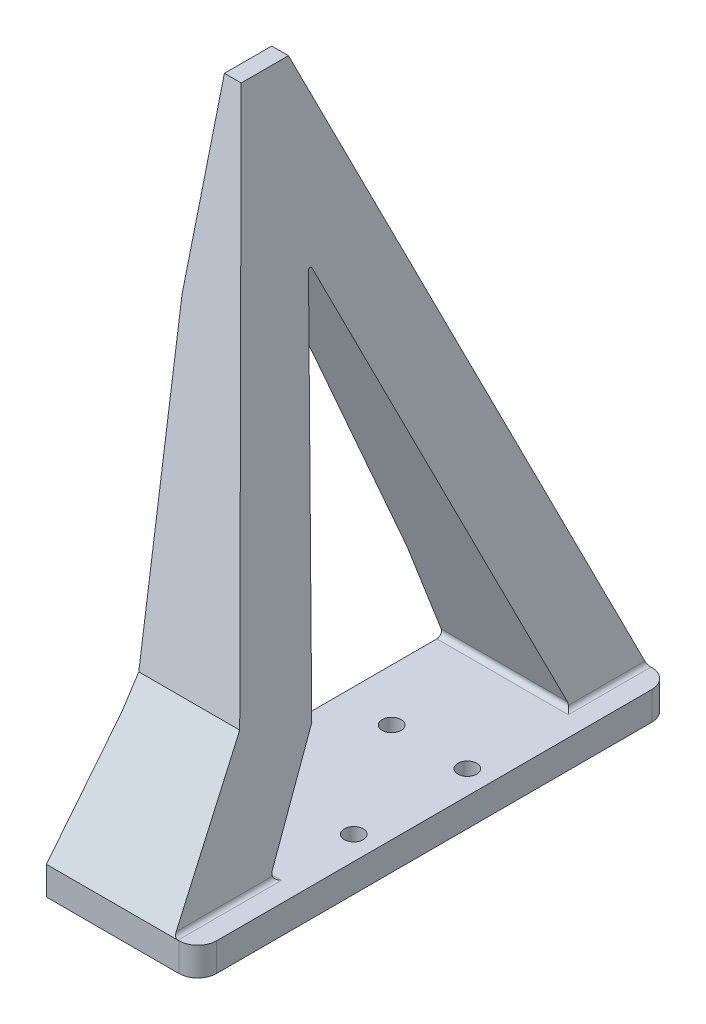
ISO-10303-21;
HEADER;
FILE_DESCRIPTION(('STEP AP214'),'2;1');
FILE_NAME('part.step','',(''),(''),'','','');
FILE_SCHEMA(('AUTOMOTIVE_DESIGN { 1 0 10303 214 1 1 1 1 }'));
ENDSEC;
DATA;
#1=APPLICATION_CONTEXT('core data for automotive mechanical design processes');
#2=APPLICATION_PROTOCOL_DEFINITION('international standard','automotive_design',2000,#1);
#3=PRODUCT_CONTEXT('',#1,'mechanical');
#4=PRODUCT('Part','Part','',(#3));
#5=PRODUCT_RELATED_PRODUCT_CATEGORY('part','',(#4));
#6=PRODUCT_DEFINITION_FORMATION('','',#4);
#7=PRODUCT_DEFINITION_CONTEXT('part definition',#1,'design');
#8=PRODUCT_DEFINITION('design','',#6,#7);
#9=PRODUCT_DEFINITION_SHAPE('','',#8);
#10=(LENGTH_UNIT() NAMED_UNIT(*) SI_UNIT(.MILLI.,.METRE.));
#11=(NAMED_UNIT(*) PLANE_ANGLE_UNIT() SI_UNIT($,.RADIAN.));
#12=(NAMED_UNIT(*) SI_UNIT($,.STERADIAN.) SOLID_ANGLE_UNIT());
#13=UNCERTAINTY_MEASURE_WITH_UNIT(LENGTH_MEASURE(1.E-05),#10,'distance_accuracy_value','');
#14=(GEOMETRIC_REPRESENTATION_CONTEXT(3) GLOBAL_UNCERTAINTY_ASSIGNED_CONTEXT((#13)) GLOBAL_UNIT_ASSIGNED_CONTEXT((#10,
#11,#12)) REPRESENTATION_CONTEXT('',''));
#15=CARTESIAN_POINT('',(0.,0.,0.));
#16=DIRECTION('',(0.,0.,1.));
#17=DIRECTION('',(1.,0.,0.));
#18=AXIS2_PLACEMENT_3D('',#15,#16,#17);
#19=CARTESIAN_POINT('',(7.25,3.,23.));
#20=DIRECTION('',(0.,1.,0.));
#21=DIRECTION('',(0.,0.,1.));
#22=AXIS2_PLACEMENT_3D('',#19,#20,#21);
#23=PLANE('',#22);
#24=DIRECTION('',(-1.,0.,0.));
#25=VECTOR('',#24,1.);
#26=CARTESIAN_POINT('',(-9.25000000000001,3.,-25.));
#27=LINE('',#26,#25);
#28=CARTESIAN_POINT('',(7.25,3.,-25.));
#29=VERTEX_POINT('',#28);
#30=CARTESIAN_POINT('',(7.14980374572616,3.,-25.));
#31=VERTEX_POINT('',#30);
#32=EDGE_CURVE('E222',#29,#31,#27,.T.);
#33=ORIENTED_EDGE('',*,*,#32,.T.);
#34=DIRECTION('',(0.,0.,-1.));
#35=VECTOR('',#34,1.);
#36=CARTESIAN_POINT('',(7.14980374572616,3.,23.));
#37=LINE('',#36,#35);
#38=CARTESIAN_POINT('',(7.14980374572616,3.,-16.2707965265877));
#39=VERTEX_POINT('',#38);
#40=EDGE_CURVE('E264',#31,#39,#37,.F.);
#41=ORIENTED_EDGE('',*,*,#40,.T.);
#42=DIRECTION('',(1.,0.,0.));
#43=VECTOR('',#42,1.);
#44=CARTESIAN_POINT('',(7.25,3.,-16.2707965265877));
#45=LINE('',#44,#43);
#46=CARTESIAN_POINT('',(-6.75,3.,-16.2707965265877));
#47=VERTEX_POINT('',#46);
#48=EDGE_CURVE('E262',#39,#47,#45,.F.);
#49=ORIENTED_EDGE('',*,*,#48,.T.);
#50=DIRECTION('',(0.,0.,-1.));
#51=VECTOR('',#50,1.);
#52=CARTESIAN_POINT('',(-6.75,3.,23.));
#53=LINE('',#52,#51);
#54=CARTESIAN_POINT('',(-6.75,3.,14.0396722192133));
#55=VERTEX_POINT('',#54);
#56=EDGE_CURVE('E387',#55,#47,#53,.T.);
#57=ORIENTED_EDGE('',*,*,#56,.F.);
#58=DIRECTION('',(1.,0.,0.));
#59=VECTOR('',#58,1.);
#60=CARTESIAN_POINT('',(7.25,3.,14.0396722192133));
#61=LINE('',#60,#59);
#62=CARTESIAN_POINT('',(7.14980374572616,3.,14.0396722192133));
#63=VERTEX_POINT('',#62);
#64=EDGE_CURVE('E257',#55,#63,#61,.T.);
#65=ORIENTED_EDGE('',*,*,#64,.T.);
#66=DIRECTION('',(0.,0.,-1.));
#67=VECTOR('',#66,1.);
#68=CARTESIAN_POINT('',(7.14980374572616,3.,23.));
#69=LINE('',#68,#67);
#70=CARTESIAN_POINT('',(7.14980374572616,3.,25.));
#71=VERTEX_POINT('',#70);
#72=EDGE_CURVE('E259',#63,#71,#69,.F.);
#73=ORIENTED_EDGE('',*,*,#72,.T.);
#74=DIRECTION('',(1.,0.,0.));
#75=VECTOR('',#74,1.);
#76=CARTESIAN_POINT('',(-9.25,3.,25.));
#77=LINE('',#76,#75);
#78=CARTESIAN_POINT('',(7.25,3.,25.));
#79=VERTEX_POINT('',#78);
#80=EDGE_CURVE('E230',#71,#79,#77,.T.);
#81=ORIENTED_EDGE('',*,*,#80,.T.);
#82=CARTESIAN_POINT('',(7.25,3.,23.));
#83=DIRECTION('',(0.,1.,0.));
#84=DIRECTION('',(0.,0.,1.));
#85=AXIS2_PLACEMENT_3D('',#82,#83,#84);
#86=CIRCLE('',#85,2.);
#87=CARTESIAN_POINT('',(9.25,3.,23.));
#88=VERTEX_POINT('',#87);
#89=EDGE_CURVE('E360',#79,#88,#86,.T.);
#90=ORIENTED_EDGE('',*,*,#89,.T.);
#91=DIRECTION('',(0.,0.,-1.));
#92=VECTOR('',#91,1.);
#93=CARTESIAN_POINT('',(9.24999999999999,3.,-23.));
#94=LINE('',#93,#92);
#95=CARTESIAN_POINT('',(9.24999999999999,3.,-23.));
#96=VERTEX_POINT('',#95);
#97=EDGE_CURVE('E362',#88,#96,#94,.T.);
#98=ORIENTED_EDGE('',*,*,#97,.T.);
#99=CARTESIAN_POINT('',(7.25,3.,-23.));
#100=DIRECTION('',(0.,1.,0.));
#101=DIRECTION('',(0.,0.,-1.));
#102=AXIS2_PLACEMENT_3D('',#99,#100,#101);
#103=CIRCLE('',#102,2.);
#104=EDGE_CURVE('E363',#96,#29,#103,.T.);
#105=ORIENTED_EDGE('',*,*,#104,.T.);
#106=EDGE_LOOP('',(#33,#41,#49,#57,#65,#73,#81,#90,#98,#105));
#107=FACE_BOUND('',#106,.T.);
#108=CARTESIAN_POINT('',(6.75,3.,6.));
#109=DIRECTION('',(0.,1.,0.));
#110=DIRECTION('',(0.,0.,1.));
#111=AXIS2_PLACEMENT_3D('',#108,#109,#110);
#112=CIRCLE('',#111,1.);
#113=CARTESIAN_POINT('',(6.75,3.,7.));
#114=VERTEX_POINT('',#113);
#115=EDGE_CURVE('E348',#114,#114,#112,.T.);
#116=ORIENTED_EDGE('',*,*,#115,.F.);
#117=EDGE_LOOP('',(#116));
#118=FACE_BOUND('',#117,.T.);
#119=CARTESIAN_POINT('',(6.75,3.,-6.));
#120=DIRECTION('',(0.,1.,0.));
#121=DIRECTION('',(0.,0.,1.));
#122=AXIS2_PLACEMENT_3D('',#119,#120,#121);
#123=CIRCLE('',#122,1.);
#124=CARTESIAN_POINT('',(6.75,3.,-5.));
#125=VERTEX_POINT('',#124);
#126=EDGE_CURVE('E340',#125,#125,#123,.T.);
#127=ORIENTED_EDGE('',*,*,#126,.F.);
#128=EDGE_LOOP('',(#127));
#129=FACE_BOUND('',#128,.T.);
#130=CARTESIAN_POINT('',(-1.25,3.,6.));
#131=DIRECTION('',(0.,1.,0.));
#132=DIRECTION('',(0.,0.,1.));
#133=AXIS2_PLACEMENT_3D('',#130,#131,#132);
#134=CIRCLE('',#133,1.);
#135=CARTESIAN_POINT('',(-1.25,3.,7.));
#136=VERTEX_POINT('',#135);
#137=EDGE_CURVE('E331',#136,#136,#134,.T.);
#138=ORIENTED_EDGE('',*,*,#137,.F.);
#139=EDGE_LOOP('',(#138));
#140=FACE_BOUND('',#139,.T.);
#141=CARTESIAN_POINT('',(-1.25,3.,-6.));
#142=DIRECTION('',(0.,1.,0.));
#143=DIRECTION('',(0.,0.,1.));
#144=AXIS2_PLACEMENT_3D('',#141,#142,#143);
#145=CIRCLE('',#144,1.);
#146=CARTESIAN_POINT('',(-1.25,3.,-5.));
#147=VERTEX_POINT('',#146);
#148=EDGE_CURVE('E347',#147,#147,#145,.T.);
#149=ORIENTED_EDGE('',*,*,#148,.F.);
#150=EDGE_LOOP('',(#149));
#151=FACE_BOUND('',#150,.T.);
#152=ADVANCED_FACE('F34',(#107,#118,#129,#140,#151),#23,.T.);
#153=CARTESIAN_POINT('',(7.25,0.,23.));
#154=DIRECTION('',(0.,1.,0.));
#155=DIRECTION('',(0.,0.,1.));
#156=AXIS2_PLACEMENT_3D('',#153,#154,#155);
#157=PLANE('',#156);
#158=DIRECTION('',(1.,0.,0.));
#159=VECTOR('',#158,1.);
#160=CARTESIAN_POINT('',(-9.25,0.,25.));
#161=LINE('',#160,#159);
#162=CARTESIAN_POINT('',(-6.75,0.,25.));
#163=VERTEX_POINT('',#162);
#164=CARTESIAN_POINT('',(7.25,0.,25.));
#165=VERTEX_POINT('',#164);
#166=EDGE_CURVE('E203',#163,#165,#161,.T.);
#167=ORIENTED_EDGE('',*,*,#166,.F.);
#168=DIRECTION('',(0.,0.,-1.));
#169=VECTOR('',#168,1.);
#170=CARTESIAN_POINT('',(-6.75,0.,25.));
#171=LINE('',#170,#169);
#172=CARTESIAN_POINT('',(-6.75000000000001,0.,-25.));
#173=VERTEX_POINT('',#172);
#174=EDGE_CURVE('E184',#163,#173,#171,.T.);
#175=ORIENTED_EDGE('',*,*,#174,.T.);
#176=DIRECTION('',(-1.,0.,0.));
#177=VECTOR('',#176,1.);
#178=CARTESIAN_POINT('',(-9.25000000000001,0.,-25.));
#179=LINE('',#178,#177);
#180=CARTESIAN_POINT('',(7.25,0.,-25.));
#181=VERTEX_POINT('',#180);
#182=EDGE_CURVE('E228',#181,#173,#179,.T.);
#183=ORIENTED_EDGE('',*,*,#182,.F.);
#184=CARTESIAN_POINT('',(7.25,0.,-23.));
#185=DIRECTION('',(0.,1.,0.));
#186=DIRECTION('',(0.,0.,-1.));
#187=AXIS2_PLACEMENT_3D('',#184,#185,#186);
#188=CIRCLE('',#187,2.);
#189=CARTESIAN_POINT('',(9.24999999999999,0.,-23.));
#190=VERTEX_POINT('',#189);
#191=EDGE_CURVE('E226',#190,#181,#188,.T.);
#192=ORIENTED_EDGE('',*,*,#191,.F.);
#193=DIRECTION('',(0.,0.,-1.));
#194=VECTOR('',#193,1.);
#195=CARTESIAN_POINT('',(9.24999999999999,0.,-23.));
#196=LINE('',#195,#194);
#197=CARTESIAN_POINT('',(9.25,0.,23.));
#198=VERTEX_POINT('',#197);
#199=EDGE_CURVE('E216',#198,#190,#196,.T.);
#200=ORIENTED_EDGE('',*,*,#199,.F.);
#201=CARTESIAN_POINT('',(7.25,0.,23.));
#202=DIRECTION('',(0.,1.,0.));
#203=DIRECTION('',(0.,0.,1.));
#204=AXIS2_PLACEMENT_3D('',#201,#202,#203);
#205=CIRCLE('',#204,2.);
#206=EDGE_CURVE('E212',#165,#198,#205,.T.);
#207=ORIENTED_EDGE('',*,*,#206,.F.);
#208=EDGE_LOOP('',(#167,#175,#183,#192,#200,#207));
#209=FACE_BOUND('',#208,.T.);
#210=CARTESIAN_POINT('',(-1.25,0.,6.));
#211=DIRECTION('',(0.,1.,0.));
#212=DIRECTION('',(0.,0.,1.));
#213=AXIS2_PLACEMENT_3D('',#210,#211,#212);
#214=CIRCLE('',#213,1.);
#215=CARTESIAN_POINT('',(-1.25,0.,7.));
#216=VERTEX_POINT('',#215);
#217=EDGE_CURVE('E214',#216,#216,#214,.T.);
#218=ORIENTED_EDGE('',*,*,#217,.T.);
#219=EDGE_LOOP('',(#218));
#220=FACE_BOUND('',#219,.T.);
#221=CARTESIAN_POINT('',(-1.25,0.,-6.));
#222=DIRECTION('',(0.,1.,0.));
#223=DIRECTION('',(0.,0.,1.));
#224=AXIS2_PLACEMENT_3D('',#221,#222,#223);
#225=CIRCLE('',#224,1.);
#226=CARTESIAN_POINT('',(-1.25,0.,-5.));
#227=VERTEX_POINT('',#226);
#228=EDGE_CURVE('E219',#227,#227,#225,.T.);
#229=ORIENTED_EDGE('',*,*,#228,.T.);
#230=EDGE_LOOP('',(#229));
#231=FACE_BOUND('',#230,.T.);
#232=CARTESIAN_POINT('',(6.75,0.,6.));
#233=DIRECTION('',(0.,1.,0.));
#234=DIRECTION('',(0.,0.,1.));
#235=AXIS2_PLACEMENT_3D('',#232,#233,#234);
#236=CIRCLE('',#235,1.);
#237=CARTESIAN_POINT('',(6.75,0.,7.));
#238=VERTEX_POINT('',#237);
#239=EDGE_CURVE('E343',#238,#238,#236,.T.);
#240=ORIENTED_EDGE('',*,*,#239,.T.);
#241=EDGE_LOOP('',(#240));
#242=FACE_BOUND('',#241,.T.);
#243=CARTESIAN_POINT('',(6.75,0.,-6.));
#244=DIRECTION('',(0.,1.,0.));
#245=DIRECTION('',(0.,0.,1.));
#246=AXIS2_PLACEMENT_3D('',#243,#244,#245);
#247=CIRCLE('',#246,1.);
#248=CARTESIAN_POINT('',(6.75,0.,-5.));
#249=VERTEX_POINT('',#248);
#250=EDGE_CURVE('E344',#249,#249,#247,.T.);
#251=ORIENTED_EDGE('',*,*,#250,.T.);
#252=EDGE_LOOP('',(#251));
#253=FACE_BOUND('',#252,.T.);
#254=ADVANCED_FACE('F209',(#209,#220,#231,#242,#253),#157,.F.);
#255=CARTESIAN_POINT('',(-9.25,3.,25.));
#256=DIRECTION('',(0.,0.,-1.));
#257=DIRECTION('',(-1.,0.,0.));
#258=AXIS2_PLACEMENT_3D('',#255,#256,#257);
#259=PLANE('',#258);
#260=DIRECTION('',(1.,0.,0.));
#261=VECTOR('',#260,1.);
#262=CARTESIAN_POINT('',(-9.25000000000001,3.,25.));
#263=LINE('',#262,#261);
#264=CARTESIAN_POINT('',(-6.75,3.,25.));
#265=VERTEX_POINT('',#264);
#266=EDGE_CURVE('E206',#265,#71,#263,.T.);
#267=ORIENTED_EDGE('',*,*,#266,.F.);
#268=DIRECTION('',(0.,-1.,0.));
#269=VECTOR('',#268,1.);
#270=CARTESIAN_POINT('',(-6.75,0.,25.));
#271=LINE('',#270,#269);
#272=EDGE_CURVE('E188',#265,#163,#271,.T.);
#273=ORIENTED_EDGE('',*,*,#272,.T.);
#274=ORIENTED_EDGE('',*,*,#166,.T.);
#275=DIRECTION('',(0.,-1.,0.));
#276=VECTOR('',#275,1.);
#277=CARTESIAN_POINT('',(7.25,3.,25.));
#278=LINE('',#277,#276);
#279=EDGE_CURVE('E240',#79,#165,#278,.T.);
#280=ORIENTED_EDGE('',*,*,#279,.F.);
#281=ORIENTED_EDGE('',*,*,#80,.F.);
#282=EDGE_LOOP('',(#267,#273,#274,#280,#281));
#283=FACE_BOUND('',#282,.T.);
#284=ADVANCED_FACE('F201',(#283),#259,.F.);
#285=CARTESIAN_POINT('',(7.25,3.,23.));
#286=DIRECTION('',(0.,-1.,0.));
#287=DIRECTION('',(0.,0.,-1.));
#288=AXIS2_PLACEMENT_3D('',#285,#286,#287);
#289=CYLINDRICAL_SURFACE('',#288,2.);
#290=ORIENTED_EDGE('',*,*,#206,.T.);
#291=DIRECTION('',(0.,-1.,0.));
#292=VECTOR('',#291,1.);
#293=CARTESIAN_POINT('',(9.25,3.,23.));
#294=LINE('',#293,#292);
#295=EDGE_CURVE('E237',#88,#198,#294,.T.);
#296=ORIENTED_EDGE('',*,*,#295,.F.);
#297=ORIENTED_EDGE('',*,*,#89,.F.);
#298=ORIENTED_EDGE('',*,*,#279,.T.);
#299=EDGE_LOOP('',(#290,#296,#297,#298));
#300=FACE_BOUND('',#299,.T.);
#301=ADVANCED_FACE('F450',(#300),#289,.T.);
#302=CARTESIAN_POINT('',(9.24999999999999,3.,-23.));
#303=DIRECTION('',(-1.,0.,0.));
#304=DIRECTION('',(0.,0.,1.));
#305=AXIS2_PLACEMENT_3D('',#302,#303,#304);
#306=PLANE('',#305);
#307=ORIENTED_EDGE('',*,*,#199,.T.);
#308=DIRECTION('',(0.,-1.,0.));
#309=VECTOR('',#308,1.);
#310=CARTESIAN_POINT('',(9.24999999999999,3.,-23.));
#311=LINE('',#310,#309);
#312=EDGE_CURVE('E234',#96,#190,#311,.T.);
#313=ORIENTED_EDGE('',*,*,#312,.F.);
#314=ORIENTED_EDGE('',*,*,#97,.F.);
#315=ORIENTED_EDGE('',*,*,#295,.T.);
#316=EDGE_LOOP('',(#307,#313,#314,#315));
#317=FACE_BOUND('',#316,.T.);
#318=ADVANCED_FACE('F455',(#317),#306,.F.);
#319=CARTESIAN_POINT('',(7.25,3.,-23.));
#320=DIRECTION('',(0.,-1.,0.));
#321=DIRECTION('',(0.,0.,-1.));
#322=AXIS2_PLACEMENT_3D('',#319,#320,#321);
#323=CYLINDRICAL_SURFACE('',#322,2.);
#324=ORIENTED_EDGE('',*,*,#191,.T.);
#325=DIRECTION('',(0.,-1.,0.));
#326=VECTOR('',#325,1.);
#327=CARTESIAN_POINT('',(7.25,3.,-25.));
#328=LINE('',#327,#326);
#329=EDGE_CURVE('E231',#29,#181,#328,.T.);
#330=ORIENTED_EDGE('',*,*,#329,.F.);
#331=ORIENTED_EDGE('',*,*,#104,.F.);
#332=ORIENTED_EDGE('',*,*,#312,.T.);
#333=EDGE_LOOP('',(#324,#330,#331,#332));
#334=FACE_BOUND('',#333,.T.);
#335=ADVANCED_FACE('F458',(#334),#323,.T.);
#336=CARTESIAN_POINT('',(-9.25000000000001,3.,-25.));
#337=DIRECTION('',(0.,0.,1.));
#338=DIRECTION('',(1.,0.,0.));
#339=AXIS2_PLACEMENT_3D('',#336,#337,#338);
#340=PLANE('',#339);
#341=ORIENTED_EDGE('',*,*,#182,.T.);
#342=DIRECTION('',(0.,-1.,0.));
#343=VECTOR('',#342,1.);
#344=CARTESIAN_POINT('',(-6.75000000000001,0.,-25.));
#345=LINE('',#344,#343);
#346=CARTESIAN_POINT('',(-6.75000000000001,3.,-25.));
#347=VERTEX_POINT('',#346);
#348=EDGE_CURVE('E191',#347,#173,#345,.T.);
#349=ORIENTED_EDGE('',*,*,#348,.F.);
#350=DIRECTION('',(1.,0.,0.));
#351=VECTOR('',#350,1.);
#352=CARTESIAN_POINT('',(-9.25000000000001,3.,-25.));
#353=LINE('',#352,#351);
#354=EDGE_CURVE('E329',#347,#31,#353,.T.);
#355=ORIENTED_EDGE('',*,*,#354,.T.);
#356=ORIENTED_EDGE('',*,*,#32,.F.);
#357=ORIENTED_EDGE('',*,*,#329,.T.);
#358=EDGE_LOOP('',(#341,#349,#355,#356,#357));
#359=FACE_BOUND('',#358,.T.);
#360=ADVANCED_FACE('F459',(#359),#340,.F.);
#361=CARTESIAN_POINT('',(-1.25,3.,6.));
#362=DIRECTION('',(0.,-1.,0.));
#363=DIRECTION('',(0.,0.,-1.));
#364=AXIS2_PLACEMENT_3D('',#361,#362,#363);
#365=CYLINDRICAL_SURFACE('',#364,1.);
#366=ORIENTED_EDGE('',*,*,#137,.T.);
#367=EDGE_LOOP('',(#366));
#368=FACE_BOUND('',#367,.T.);
#369=ORIENTED_EDGE('',*,*,#217,.F.);
#370=EDGE_LOOP('',(#369));
#371=FACE_BOUND('',#370,.T.);
#372=ADVANCED_FACE('F462',(#368,#371),#365,.F.);
#373=CARTESIAN_POINT('',(-1.25,3.,-6.));
#374=DIRECTION('',(0.,-1.,0.));
#375=DIRECTION('',(0.,0.,-1.));
#376=AXIS2_PLACEMENT_3D('',#373,#374,#375);
#377=CYLINDRICAL_SURFACE('',#376,1.);
#378=ORIENTED_EDGE('',*,*,#148,.T.);
#379=EDGE_LOOP('',(#378));
#380=FACE_BOUND('',#379,.T.);
#381=ORIENTED_EDGE('',*,*,#228,.F.);
#382=EDGE_LOOP('',(#381));
#383=FACE_BOUND('',#382,.T.);
#384=ADVANCED_FACE('F468',(#380,#383),#377,.F.);
#385=CARTESIAN_POINT('',(6.75,3.,6.));
#386=DIRECTION('',(0.,-1.,0.));
#387=DIRECTION('',(0.,0.,-1.));
#388=AXIS2_PLACEMENT_3D('',#385,#386,#387);
#389=CYLINDRICAL_SURFACE('',#388,1.);
#390=ORIENTED_EDGE('',*,*,#115,.T.);
#391=EDGE_LOOP('',(#390));
#392=FACE_BOUND('',#391,.T.);
#393=ORIENTED_EDGE('',*,*,#239,.F.);
#394=EDGE_LOOP('',(#393));
#395=FACE_BOUND('',#394,.T.);
#396=ADVANCED_FACE('F481',(#392,#395),#389,.F.);
#397=CARTESIAN_POINT('',(6.75,3.,-6.));
#398=DIRECTION('',(0.,-1.,0.));
#399=DIRECTION('',(0.,0.,-1.));
#400=AXIS2_PLACEMENT_3D('',#397,#398,#399);
#401=CYLINDRICAL_SURFACE('',#400,1.);
#402=ORIENTED_EDGE('',*,*,#126,.T.);
#403=EDGE_LOOP('',(#402));
#404=FACE_BOUND('',#403,.T.);
#405=ORIENTED_EDGE('',*,*,#250,.F.);
#406=EDGE_LOOP('',(#405));
#407=FACE_BOUND('',#406,.T.);
#408=ADVANCED_FACE('F485',(#404,#407),#401,.F.);
#409=CARTESIAN_POINT('',(-9.25000000000001,3.,-25.));
#410=DIRECTION('',(0.,-0.360399279202162,0.932798134405597));
#411=DIRECTION('',(0.,-0.932798134405597,-0.360399279202162));
#412=AXIS2_PLACEMENT_3D('',#409,#410,#411);
#413=PLANE('',#412);
#414=ORIENTED_EDGE('',*,*,#354,.F.);
#415=DIRECTION('',(0.,0.932798134405597,0.360399279202162));
#416=VECTOR('',#415,1.);
#417=CARTESIAN_POINT('',(-6.75000000000001,3.,-25.));
#418=LINE('',#417,#416);
#419=CARTESIAN_POINT('',(-6.75000000000001,13.,-21.1363636363636));
#420=VERTEX_POINT('',#419);
#421=EDGE_CURVE('E308',#347,#420,#418,.T.);
#422=ORIENTED_EDGE('',*,*,#421,.T.);
#423=DIRECTION('',(-0.0871173458188335,0.929251688734225,0.359029061556405));
#424=VECTOR('',#423,1.);
#425=CARTESIAN_POINT('',(-5.83858867230241,3.27827917122567,-24.892483047481));
#426=LINE('',#425,#424);
#427=CARTESIAN_POINT('',(-9.75,45.,-8.77272727272726));
#428=VERTEX_POINT('',#427);
#429=EDGE_CURVE('E393',#420,#428,#426,.T.);
#430=ORIENTED_EDGE('',*,*,#429,.T.);
#431=DIRECTION('',(0.,0.932798134405597,0.360399279202162));
#432=VECTOR('',#431,1.);
#433=CARTESIAN_POINT('',(-9.75000000000001,3.,-25.));
#434=LINE('',#433,#432);
#435=CARTESIAN_POINT('',(-9.75,63.,-1.81818181818181));
#436=VERTEX_POINT('',#435);
#437=EDGE_CURVE('E428',#428,#436,#434,.T.);
#438=ORIENTED_EDGE('',*,*,#437,.T.);
#439=DIRECTION('',(1.,0.,0.));
#440=VECTOR('',#439,1.);
#441=CARTESIAN_POINT('',(-9.25000000000001,63.,-1.81818181818181));
#442=LINE('',#441,#440);
#443=CARTESIAN_POINT('',(-7.97965984121771,63.,-1.81818181818181));
#444=VERTEX_POINT('',#443);
#445=EDGE_CURVE('E332',#436,#444,#442,.T.);
#446=ORIENTED_EDGE('',*,*,#445,.T.);
#447=DIRECTION('',(0.223330342013913,-0.909238280764876,-0.351296608477339));
#448=VECTOR('',#447,1.);
#449=CARTESIAN_POINT('',(5.9593438747438,6.25054240284771,-23.7441086170816));
#450=LINE('',#449,#448);
#451=CARTESIAN_POINT('',(6.66423660577135,3.38073327121071,-24.8528985088504));
#452=VERTEX_POINT('',#451);
#453=EDGE_CURVE('E324',#444,#452,#450,.T.);
#454=ORIENTED_EDGE('',*,*,#453,.T.);
#455=CARTESIAN_POINT('',(7.14980374572616,3.5,-24.8068181818182));
#456=DIRECTION('',(0.,-0.360399279202162,0.932798134405597));
#457=DIRECTION('',(0.,-0.932798134405597,-0.360399279202162));
#458=AXIS2_PLACEMENT_3D('',#455,#456,#457);
#459=ELLIPSE('',#458,0.536021655230489,0.5);
#460=EDGE_CURVE('E270',#452,#31,#459,.T.);
#461=ORIENTED_EDGE('',*,*,#460,.T.);
#462=EDGE_LOOP('',(#414,#422,#430,#438,#446,#454,#461));
#463=FACE_BOUND('',#462,.T.);
#464=ADVANCED_FACE('F375',(#463),#413,.F.);
#465=CARTESIAN_POINT('',(-9.25000000000001,63.,-1.81818181818181));
#466=DIRECTION('',(0.,-1.,0.));
#467=DIRECTION('',(0.,0.,-1.));
#468=AXIS2_PLACEMENT_3D('',#465,#466,#467);
#469=PLANE('',#468);
#470=ORIENTED_EDGE('',*,*,#445,.F.);
#471=DIRECTION('',(0.,0.,1.));
#472=VECTOR('',#471,1.);
#473=CARTESIAN_POINT('',(-9.75,63.,-1.81818181818181));
#474=LINE('',#473,#472);
#475=CARTESIAN_POINT('',(-9.75,63.,3.18181818181819));
#476=VERTEX_POINT('',#475);
#477=EDGE_CURVE('E425',#436,#476,#474,.T.);
#478=ORIENTED_EDGE('',*,*,#477,.T.);
#479=DIRECTION('',(1.,0.,0.));
#480=VECTOR('',#479,1.);
#481=CARTESIAN_POINT('',(-9.25000000000001,63.,3.18181818181819));
#482=LINE('',#481,#480);
#483=CARTESIAN_POINT('',(-7.97965984121771,63.,3.18181818181819));
#484=VERTEX_POINT('',#483);
#485=EDGE_CURVE('E334',#476,#484,#482,.T.);
#486=ORIENTED_EDGE('',*,*,#485,.T.);
#487=DIRECTION('',(0.,0.,-1.));
#488=VECTOR('',#487,1.);
#489=CARTESIAN_POINT('',(-7.97965984121771,63.,-1.81818181818181));
#490=LINE('',#489,#488);
#491=EDGE_CURVE('E321',#484,#444,#490,.T.);
#492=ORIENTED_EDGE('',*,*,#491,.T.);
#493=EDGE_LOOP('',(#470,#478,#486,#492));
#494=FACE_BOUND('',#493,.T.);
#495=ADVANCED_FACE('F495',(#494),#469,.F.);
#496=CARTESIAN_POINT('',(-9.25000000000001,63.,3.18181818181819));
#497=DIRECTION('',(0.,-0.241442969126738,-0.970415010528622));
#498=DIRECTION('',(0.,0.970415010528622,-0.241442969126738));
#499=AXIS2_PLACEMENT_3D('',#496,#497,#498);
#500=PLANE('',#499);
#501=DIRECTION('',(0.,-0.970415010528622,0.241442969126738));
#502=VECTOR('',#501,1.);
#503=CARTESIAN_POINT('',(-9.75,63.,3.18181818181819));
#504=LINE('',#503,#502);
#505=CARTESIAN_POINT('',(-9.75,45.,7.66028708133972));
#506=VERTEX_POINT('',#505);
#507=EDGE_CURVE('E423',#476,#506,#504,.T.);
#508=ORIENTED_EDGE('',*,*,#507,.T.);
#509=DIRECTION('',(0.0906022358035754,-0.96642384857147,0.240449952754624));
#510=VECTOR('',#509,1.);
#511=CARTESIAN_POINT('',(-11.4195433262724,62.8084621469058,3.22947353282726));
#512=LINE('',#511,#510);
#513=CARTESIAN_POINT('',(-6.984375,15.5,15.));
#514=VERTEX_POINT('',#513);
#515=EDGE_CURVE('E397',#506,#514,#512,.T.);
#516=ORIENTED_EDGE('',*,*,#515,.T.);
#517=DIRECTION('',(1.,0.,0.));
#518=VECTOR('',#517,1.);
#519=CARTESIAN_POINT('',(-9.25000000000001,15.5,15.));
#520=LINE('',#519,#518);
#521=CARTESIAN_POINT('',(3.6874591858617,15.5,15.));
#522=VERTEX_POINT('',#521);
#523=EDGE_CURVE('E336',#514,#522,#520,.T.);
#524=ORIENTED_EDGE('',*,*,#523,.T.);
#525=DIRECTION('',(-0.231861293381906,0.943970093223388,-0.234863372476632));
#526=VECTOR('',#525,1.);
#527=CARTESIAN_POINT('',(-8.04795289543626,63.2780395115411,3.11264088708068));
#528=LINE('',#527,#526);
#529=EDGE_CURVE('E318',#522,#484,#528,.T.);
#530=ORIENTED_EDGE('',*,*,#529,.T.);
#531=ORIENTED_EDGE('',*,*,#485,.F.);
#532=EDGE_LOOP('',(#508,#516,#524,#530,#531));
#533=FACE_BOUND('',#532,.T.);
#534=ADVANCED_FACE('F435',(#533),#500,.F.);
#535=CARTESIAN_POINT('',(-9.25000000000001,3.,25.));
#536=DIRECTION('',(0.,-0.624695047554425,-0.78086880944303));
#537=DIRECTION('',(0.,0.78086880944303,-0.624695047554425));
#538=AXIS2_PLACEMENT_3D('',#535,#536,#537);
#539=PLANE('',#538);
#540=DIRECTION('',(0.0730110724008512,-0.778784772275745,0.623027817820596));
#541=VECTOR('',#540,1.);
#542=CARTESIAN_POINT('',(-5.8308239948826,3.19545594541449,24.8436352436684));
#543=LINE('',#542,#541);
#544=CARTESIAN_POINT('',(-6.75,13.,17.));
#545=VERTEX_POINT('',#544);
#546=EDGE_CURVE('E404',#514,#545,#543,.T.);
#547=ORIENTED_EDGE('',*,*,#546,.T.);
#548=DIRECTION('',(0.,-0.78086880944303,0.624695047554425));
#549=VECTOR('',#548,1.);
#550=CARTESIAN_POINT('',(-6.75,3.,25.));
#551=LINE('',#550,#549);
#552=EDGE_CURVE('E313',#545,#265,#551,.T.);
#553=ORIENTED_EDGE('',*,*,#552,.T.);
#554=ORIENTED_EDGE('',*,*,#266,.T.);
#555=CARTESIAN_POINT('',(7.14980374572616,3.5,24.6));
#556=DIRECTION('',(0.,-0.624695047554425,-0.78086880944303));
#557=DIRECTION('',(0.,0.78086880944303,-0.624695047554425));
#558=AXIS2_PLACEMENT_3D('',#555,#556,#557);
#559=ELLIPSE('',#558,0.640312423743285,0.5);
#560=CARTESIAN_POINT('',(6.66423660577135,3.38073327121071,24.6954133830314));
#561=VERTEX_POINT('',#560);
#562=EDGE_CURVE('E273',#71,#561,#559,.T.);
#563=ORIENTED_EDGE('',*,*,#562,.T.);
#564=DIRECTION('',(-0.188366336395068,0.766890348679804,-0.613512278943844));
#565=VECTOR('',#564,1.);
#566=CARTESIAN_POINT('',(6.18976852503695,5.31242127255662,23.1500629819547));
#567=LINE('',#566,#565);
#568=EDGE_CURVE('E310',#561,#522,#567,.T.);
#569=ORIENTED_EDGE('',*,*,#568,.T.);
#570=ORIENTED_EDGE('',*,*,#523,.F.);
#571=EDGE_LOOP('',(#547,#553,#554,#563,#569,#570));
#572=FACE_BOUND('',#571,.T.);
#573=ADVANCED_FACE('F402',(#572),#539,.F.);
#574=CARTESIAN_POINT('',(-9.25000000000001,47.,0.));
#575=DIRECTION('',(0.,0.360399279202162,-0.932798134405597));
#576=DIRECTION('',(0.,0.932798134405597,0.360399279202162));
#577=AXIS2_PLACEMENT_3D('',#574,#575,#576);
#578=PLANE('',#577);
#579=DIRECTION('',(-0.223330342013913,0.909238280764876,0.351296608477338));
#580=VECTOR('',#579,1.);
#581=CARTESIAN_POINT('',(-4.30905621796484,48.0559789696295,0.407991874629562));
#582=LINE('',#581,#580);
#583=CARTESIAN_POINT('',(6.59068061072676,3.68019963960109,-16.7371955937905));
#584=VERTEX_POINT('',#583);
#585=CARTESIAN_POINT('',(-3.90149217050866,46.3966753995505,-0.233102686537296));
#586=VERTEX_POINT('',#585);
#587=EDGE_CURVE('E307',#584,#586,#582,.T.);
#588=ORIENTED_EDGE('',*,*,#587,.T.);
#589=DIRECTION('',(1.,0.,0.));
#590=VECTOR('',#589,1.);
#591=CARTESIAN_POINT('',(-9.75,46.3966753995505,-0.233102686537294));
#592=LINE('',#591,#590);
#593=CARTESIAN_POINT('',(-9.75,46.3966753995505,-0.233102686537295));
#594=VERTEX_POINT('',#593);
#595=EDGE_CURVE('E49',#586,#594,#592,.F.);
#596=ORIENTED_EDGE('',*,*,#595,.T.);
#597=DIRECTION('',(0.,-0.932798134405597,-0.360399279202162));
#598=VECTOR('',#597,1.);
#599=CARTESIAN_POINT('',(-9.75,47.,0.));
#600=LINE('',#599,#598);
#601=CARTESIAN_POINT('',(-9.75,45.,-0.772727272727273));
#602=VERTEX_POINT('',#601);
#603=EDGE_CURVE('E196',#594,#602,#600,.T.);
#604=ORIENTED_EDGE('',*,*,#603,.T.);
#605=DIRECTION('',(0.0871173458188335,-0.929251688734225,-0.359029061556405));
#606=VECTOR('',#605,1.);
#607=CARTESIAN_POINT('',(-9.93228226553952,46.9443441657549,-0.0215033905038015));
#608=LINE('',#607,#606);
#609=CARTESIAN_POINT('',(-6.75,13.,-13.1363636363636));
#610=VERTEX_POINT('',#609);
#611=EDGE_CURVE('E431',#602,#610,#608,.T.);
#612=ORIENTED_EDGE('',*,*,#611,.T.);
#613=DIRECTION('',(0.,-0.932798134405597,-0.360399279202162));
#614=VECTOR('',#613,1.);
#615=CARTESIAN_POINT('',(-6.75,47.,0.));
#616=LINE('',#615,#614);
#617=CARTESIAN_POINT('',(-6.75,3.68019963960108,-16.7371955937905));
#618=VERTEX_POINT('',#617);
#619=EDGE_CURVE('E392',#610,#618,#616,.T.);
#620=ORIENTED_EDGE('',*,*,#619,.T.);
#621=DIRECTION('',(1.,0.,0.));
#622=VECTOR('',#621,1.);
#623=CARTESIAN_POINT('',(-9.25000000000001,3.68019963960108,-16.7371955937905));
#624=LINE('',#623,#622);
#625=EDGE_CURVE('E266',#618,#584,#624,.T.);
#626=ORIENTED_EDGE('',*,*,#625,.T.);
#627=EDGE_LOOP('',(#588,#596,#604,#612,#620,#626));
#628=FACE_BOUND('',#627,.T.);
#629=ADVANCED_FACE('F492',(#628),#578,.F.);
#630=CARTESIAN_POINT('',(-9.25000000000001,3.,15.));
#631=DIRECTION('',(0.,0.573462344363329,0.81923192051904));
#632=DIRECTION('',(0.,-0.81923192051904,0.573462344363329));
#633=AXIS2_PLACEMENT_3D('',#630,#631,#632);
#634=PLANE('',#633);
#635=DIRECTION('',(0.197268532025354,-0.803133597030762,0.562193517921535));
#636=VECTOR('',#635,1.);
#637=CARTESIAN_POINT('',(6.1348139540736,5.53615620786505,13.2246906544945));
#638=LINE('',#637,#636);
#639=CARTESIAN_POINT('',(4.30151808202378,13.,8.));
#640=VERTEX_POINT('',#639);
#641=CARTESIAN_POINT('',(6.56451395660561,3.78673117218166,14.4492881794728));
#642=VERTEX_POINT('',#641);
#643=EDGE_CURVE('E303',#640,#642,#638,.T.);
#644=ORIENTED_EDGE('',*,*,#643,.T.);
#645=DIRECTION('',(1.,0.,0.));
#646=VECTOR('',#645,1.);
#647=CARTESIAN_POINT('',(-9.25000000000001,3.78673117218166,14.4492881794728));
#648=LINE('',#647,#646);
#649=CARTESIAN_POINT('',(-6.75,3.78673117218166,14.4492881794728));
#650=VERTEX_POINT('',#649);
#651=EDGE_CURVE('E268',#642,#650,#648,.F.);
#652=ORIENTED_EDGE('',*,*,#651,.T.);
#653=DIRECTION('',(0.,0.81923192051904,-0.573462344363329));
#654=VECTOR('',#653,1.);
#655=CARTESIAN_POINT('',(-6.75,3.,15.));
#656=LINE('',#655,#654);
#657=CARTESIAN_POINT('',(-6.75,13.,8.));
#658=VERTEX_POINT('',#657);
#659=EDGE_CURVE('E250',#650,#658,#656,.T.);
#660=ORIENTED_EDGE('',*,*,#659,.T.);
#661=DIRECTION('',(1.,0.,0.));
#662=VECTOR('',#661,1.);
#663=CARTESIAN_POINT('',(-9.25000000000001,13.,8.));
#664=LINE('',#663,#662);
#665=EDGE_CURVE('E327',#658,#640,#664,.T.);
#666=ORIENTED_EDGE('',*,*,#665,.T.);
#667=EDGE_LOOP('',(#644,#652,#660,#666));
#668=FACE_BOUND('',#667,.T.);
#669=ADVANCED_FACE('F410',(#668),#634,.F.);
#670=CARTESIAN_POINT('',(-9.25000000000001,13.,8.));
#671=DIRECTION('',(0.,0.229039333725547,0.973417168333576));
#672=DIRECTION('',(0.,-0.973417168333576,0.229039333725547));
#673=AXIS2_PLACEMENT_3D('',#670,#671,#672);
#674=PLANE('',#673);
#675=DIRECTION('',(0.,0.973417168333576,-0.229039333725547));
#676=VECTOR('',#675,1.);
#677=CARTESIAN_POINT('',(-9.75,13.,8.));
#678=LINE('',#677,#676);
#679=CARTESIAN_POINT('',(-9.75,45.,0.470588235294116));
#680=VERTEX_POINT('',#679);
#681=CARTESIAN_POINT('',(-9.75,46.3704034104552,0.148140374010539));
#682=VERTEX_POINT('',#681);
#683=EDGE_CURVE('E244',#680,#682,#678,.T.);
#684=ORIENTED_EDGE('',*,*,#683,.T.);
#685=DIRECTION('',(1.,0.,0.));
#686=VECTOR('',#685,1.);
#687=CARTESIAN_POINT('',(-4.04968290578043,46.3704034104552,0.148140374010538));
#688=LINE('',#687,#686);
#689=CARTESIAN_POINT('',(-3.89503915105912,46.3704034104552,0.148140374010539));
#690=VERTEX_POINT('',#689);
#691=EDGE_CURVE('E284',#682,#690,#688,.T.);
#692=ORIENTED_EDGE('',*,*,#691,.T.);
#693=DIRECTION('',(0.232539867489788,-0.946732752115406,0.222760647556566));
#694=VECTOR('',#693,1.);
#695=CARTESIAN_POINT('',(3.56872258793431,15.9834088337027,7.29802145089347));
#696=LINE('',#695,#694);
#697=EDGE_CURVE('E242',#690,#640,#696,.T.);
#698=ORIENTED_EDGE('',*,*,#697,.T.);
#699=ORIENTED_EDGE('',*,*,#665,.F.);
#700=DIRECTION('',(-0.0908802190557917,0.969389003261778,-0.228091530179242));
#701=VECTOR('',#700,1.);
#702=CARTESIAN_POINT('',(-6.77064803553907,13.2202457124168,7.94817747943135));
#703=LINE('',#702,#701);
#704=EDGE_CURVE('E247',#658,#680,#703,.T.);
#705=ORIENTED_EDGE('',*,*,#704,.T.);
#706=EDGE_LOOP('',(#684,#692,#698,#699,#705));
#707=FACE_BOUND('',#706,.T.);
#708=ADVANCED_FACE('F295',(#707),#674,.F.);
#709=CARTESIAN_POINT('',(-9.14963747048728,67.763295656907,-25.));
#710=DIRECTION('',(-0.971134279909635,-0.238533457578585,0.));
#711=DIRECTION('',(0.238533457578585,-0.971134279909635,0.));
#712=AXIS2_PLACEMENT_3D('',#709,#710,#711);
#713=PLANE('',#712);
#714=ORIENTED_EDGE('',*,*,#587,.F.);
#715=CARTESIAN_POINT('',(6.63494188743966,3.5,-16.2707965265877));
#716=DIRECTION('',(-0.971134279909635,-0.238533457578585,0.));
#717=DIRECTION('',(0.238533457578585,-0.971134279909635,0.));
#718=AXIS2_PLACEMENT_3D('',#715,#716,#717);
#719=ELLIPSE('',#718,0.514861858286503,0.5);
#720=CARTESIAN_POINT('',(6.66423660577135,3.38073327121071,-16.7563636665425));
#721=VERTEX_POINT('',#720);
#722=EDGE_CURVE('E275',#584,#721,#719,.T.);
#723=ORIENTED_EDGE('',*,*,#722,.T.);
#724=DIRECTION('',(0.,0.,-1.));
#725=VECTOR('',#724,1.);
#726=CARTESIAN_POINT('',(6.66423660577135,3.38073327121072,-25.));
#727=LINE('',#726,#725);
#728=EDGE_CURVE('E254',#721,#452,#727,.T.);
#729=ORIENTED_EDGE('',*,*,#728,.T.);
#730=ORIENTED_EDGE('',*,*,#453,.F.);
#731=ORIENTED_EDGE('',*,*,#491,.F.);
#732=ORIENTED_EDGE('',*,*,#529,.F.);
#733=ORIENTED_EDGE('',*,*,#568,.F.);
#734=DIRECTION('',(0.,0.,-1.));
#735=VECTOR('',#734,1.);
#736=CARTESIAN_POINT('',(6.66423660577135,3.38073327121072,-25.));
#737=LINE('',#736,#735);
#738=CARTESIAN_POINT('',(6.66423660577135,3.38073327121071,14.5252393591681));
#739=VERTEX_POINT('',#738);
#740=EDGE_CURVE('E252',#561,#739,#737,.T.);
#741=ORIENTED_EDGE('',*,*,#740,.T.);
#742=CARTESIAN_POINT('',(6.63494188743966,3.5,14.0396722192133));
#743=DIRECTION('',(-0.971134279909635,-0.238533457578585,0.));
#744=DIRECTION('',(0.238533457578585,-0.971134279909635,0.));
#745=AXIS2_PLACEMENT_3D('',#742,#743,#744);
#746=ELLIPSE('',#745,0.514861858286503,0.5);
#747=EDGE_CURVE('E280',#739,#642,#746,.T.);
#748=ORIENTED_EDGE('',*,*,#747,.T.);
#749=ORIENTED_EDGE('',*,*,#643,.F.);
#750=ORIENTED_EDGE('',*,*,#697,.F.);
#751=CARTESIAN_POINT('',(-3.8837876598235,46.3245955437101,-0.0465430596561763));
#752=DIRECTION('',(-0.971134279909635,-0.238533457578585,0.));
#753=DIRECTION('',(-0.238533457578585,0.971134279909635,0.));
#754=AXIS2_PLACEMENT_3D('',#751,#752,#753);
#755=ELLIPSE('',#754,0.205944743314601,0.2);
#756=EDGE_CURVE('E42',#690,#586,#755,.T.);
#757=ORIENTED_EDGE('',*,*,#756,.T.);
#758=EDGE_LOOP('',(#714,#723,#729,#730,#731,#732,#733,#741,#748,#749,#750,#757));
#759=FACE_BOUND('',#758,.T.);
#760=ADVANCED_FACE('F301',(#759),#713,.F.);
#761=CARTESIAN_POINT('',(-6.75,0.,25.));
#762=DIRECTION('',(1.,0.,0.));
#763=DIRECTION('',(0.,0.,-1.));
#764=AXIS2_PLACEMENT_3D('',#761,#762,#763);
#765=PLANE('',#764);
#766=ORIENTED_EDGE('',*,*,#348,.T.);
#767=ORIENTED_EDGE('',*,*,#174,.F.);
#768=ORIENTED_EDGE('',*,*,#272,.F.);
#769=ORIENTED_EDGE('',*,*,#552,.F.);
#770=DIRECTION('',(0.,0.,-1.));
#771=VECTOR('',#770,1.);
#772=CARTESIAN_POINT('',(-6.75,13.,25.));
#773=LINE('',#772,#771);
#774=EDGE_CURVE('E197',#545,#658,#773,.T.);
#775=ORIENTED_EDGE('',*,*,#774,.T.);
#776=ORIENTED_EDGE('',*,*,#659,.F.);
#777=CARTESIAN_POINT('',(-6.75,3.5,14.0396722192133));
#778=DIRECTION('',(1.,0.,0.));
#779=DIRECTION('',(0.,0.,-1.));
#780=AXIS2_PLACEMENT_3D('',#777,#778,#779);
#781=CIRCLE('',#780,0.5);
#782=EDGE_CURVE('E282',#650,#55,#781,.T.);
#783=ORIENTED_EDGE('',*,*,#782,.T.);
#784=ORIENTED_EDGE('',*,*,#56,.T.);
#785=CARTESIAN_POINT('',(-6.75,3.5,-16.2707965265877));
#786=DIRECTION('',(1.,0.,0.));
#787=DIRECTION('',(0.,0.,-1.));
#788=AXIS2_PLACEMENT_3D('',#785,#786,#787);
#789=CIRCLE('',#788,0.5);
#790=EDGE_CURVE('E278',#47,#618,#789,.T.);
#791=ORIENTED_EDGE('',*,*,#790,.T.);
#792=ORIENTED_EDGE('',*,*,#619,.F.);
#793=EDGE_CURVE('E408',#610,#420,#773,.T.);
#794=ORIENTED_EDGE('',*,*,#793,.T.);
#795=ORIENTED_EDGE('',*,*,#421,.F.);
#796=EDGE_LOOP('',(#766,#767,#768,#769,#775,#776,#783,#784,#791,#792,#794,#795));
#797=FACE_BOUND('',#796,.T.);
#798=ADVANCED_FACE('F186',(#797),#765,.F.);
#799=CARTESIAN_POINT('',(-6.75,13.,25.));
#800=DIRECTION('',(0.995634226059288,0.0933407086930582,0.));
#801=DIRECTION('',(-0.0933407086930582,0.995634226059288,0.));
#802=AXIS2_PLACEMENT_3D('',#799,#800,#801);
#803=PLANE('',#802);
#804=ORIENTED_EDGE('',*,*,#793,.F.);
#805=ORIENTED_EDGE('',*,*,#611,.F.);
#806=DIRECTION('',(0.,0.,-1.));
#807=VECTOR('',#806,1.);
#808=CARTESIAN_POINT('',(-9.74999999999999,45.,25.));
#809=LINE('',#808,#807);
#810=EDGE_CURVE('E207',#602,#428,#809,.T.);
#811=ORIENTED_EDGE('',*,*,#810,.T.);
#812=ORIENTED_EDGE('',*,*,#429,.F.);
#813=EDGE_LOOP('',(#804,#805,#811,#812));
#814=FACE_BOUND('',#813,.T.);
#815=ADVANCED_FACE('F512',(#814),#803,.F.);
#816=EDGE_CURVE('E414',#506,#680,#809,.T.);
#817=ORIENTED_EDGE('',*,*,#816,.T.);
#818=ORIENTED_EDGE('',*,*,#704,.F.);
#819=ORIENTED_EDGE('',*,*,#774,.F.);
#820=ORIENTED_EDGE('',*,*,#546,.F.);
#821=ORIENTED_EDGE('',*,*,#515,.F.);
#822=EDGE_LOOP('',(#817,#818,#819,#820,#821));
#823=FACE_BOUND('',#822,.T.);
#824=ADVANCED_FACE('F412',(#823),#803,.F.);
#825=CARTESIAN_POINT('',(-9.74999999999999,45.,25.));
#826=DIRECTION('',(1.,0.,0.));
#827=DIRECTION('',(0.,0.,-1.));
#828=AXIS2_PLACEMENT_3D('',#825,#826,#827);
#829=PLANE('',#828);
#830=ORIENTED_EDGE('',*,*,#810,.F.);
#831=ORIENTED_EDGE('',*,*,#603,.F.);
#832=CARTESIAN_POINT('',(-9.75,46.3245955437101,-0.0465430596561763));
#833=DIRECTION('',(1.,0.,0.));
#834=DIRECTION('',(0.,0.,-1.));
#835=AXIS2_PLACEMENT_3D('',#832,#833,#834);
#836=CIRCLE('',#835,0.2);
#837=EDGE_CURVE('E11',#594,#682,#836,.T.);
#838=ORIENTED_EDGE('',*,*,#837,.T.);
#839=ORIENTED_EDGE('',*,*,#683,.F.);
#840=ORIENTED_EDGE('',*,*,#816,.F.);
#841=ORIENTED_EDGE('',*,*,#507,.F.);
#842=ORIENTED_EDGE('',*,*,#477,.F.);
#843=ORIENTED_EDGE('',*,*,#437,.F.);
#844=EDGE_LOOP('',(#830,#831,#838,#839,#840,#841,#842,#843));
#845=FACE_BOUND('',#844,.T.);
#846=ADVANCED_FACE('F509',(#845),#829,.F.);
#847=CARTESIAN_POINT('',(-9.25000000000001,3.5,-16.2707965265877));
#848=DIRECTION('',(1.,0.,0.));
#849=DIRECTION('',(0.,0.,-1.));
#850=AXIS2_PLACEMENT_3D('',#847,#848,#849);
#851=CYLINDRICAL_SURFACE('',#850,0.5);
#852=ORIENTED_EDGE('',*,*,#790,.F.);
#853=ORIENTED_EDGE('',*,*,#48,.F.);
#854=CARTESIAN_POINT('',(7.14980374572616,3.5,-16.2707965265877));
#855=DIRECTION('',(0.707106781186547,0.,-0.707106781186547));
#856=DIRECTION('',(0.707106781186547,0.,0.707106781186547));
#857=AXIS2_PLACEMENT_3D('',#854,#855,#856);
#858=ELLIPSE('',#857,0.707106781186547,0.5);
#859=EDGE_CURVE('E285',#721,#39,#858,.F.);
#860=ORIENTED_EDGE('',*,*,#859,.F.);
#861=ORIENTED_EDGE('',*,*,#722,.F.);
#862=ORIENTED_EDGE('',*,*,#625,.F.);
#863=EDGE_LOOP('',(#852,#853,#860,#861,#862));
#864=FACE_BOUND('',#863,.T.);
#865=ADVANCED_FACE('F383',(#864),#851,.F.);
#866=CARTESIAN_POINT('',(7.14980374572616,3.5,-25.));
#867=DIRECTION('',(0.,0.,-1.));
#868=DIRECTION('',(-1.,0.,0.));
#869=AXIS2_PLACEMENT_3D('',#866,#867,#868);
#870=CYLINDRICAL_SURFACE('',#869,0.5);
#871=ORIENTED_EDGE('',*,*,#859,.T.);
#872=ORIENTED_EDGE('',*,*,#40,.F.);
#873=ORIENTED_EDGE('',*,*,#460,.F.);
#874=ORIENTED_EDGE('',*,*,#728,.F.);
#875=EDGE_LOOP('',(#871,#872,#873,#874));
#876=FACE_BOUND('',#875,.T.);
#877=ADVANCED_FACE('F378',(#876),#870,.F.);
#878=CARTESIAN_POINT('',(7.25,3.5,14.0396722192133));
#879=DIRECTION('',(1.,0.,0.));
#880=DIRECTION('',(0.,0.,-1.));
#881=AXIS2_PLACEMENT_3D('',#878,#879,#880);
#882=CYLINDRICAL_SURFACE('',#881,0.5);
#883=ORIENTED_EDGE('',*,*,#651,.F.);
#884=ORIENTED_EDGE('',*,*,#747,.F.);
#885=CARTESIAN_POINT('',(7.14980374572616,3.5,14.0396722192133));
#886=DIRECTION('',(0.707106781186547,0.,0.707106781186548));
#887=DIRECTION('',(0.707106781186547,0.,-0.707106781186548));
#888=AXIS2_PLACEMENT_3D('',#885,#886,#887);
#889=ELLIPSE('',#888,0.707106781186547,0.5);
#890=EDGE_CURVE('E288',#63,#739,#889,.F.);
#891=ORIENTED_EDGE('',*,*,#890,.F.);
#892=ORIENTED_EDGE('',*,*,#64,.F.);
#893=ORIENTED_EDGE('',*,*,#782,.F.);
#894=EDGE_LOOP('',(#883,#884,#891,#892,#893));
#895=FACE_BOUND('',#894,.T.);
#896=ADVANCED_FACE('F447',(#895),#882,.F.);
#897=CARTESIAN_POINT('',(7.14980374572616,3.5,-25.));
#898=DIRECTION('',(0.,0.,-1.));
#899=DIRECTION('',(-1.,0.,0.));
#900=AXIS2_PLACEMENT_3D('',#897,#898,#899);
#901=CYLINDRICAL_SURFACE('',#900,0.5);
#902=ORIENTED_EDGE('',*,*,#562,.F.);
#903=ORIENTED_EDGE('',*,*,#72,.F.);
#904=ORIENTED_EDGE('',*,*,#890,.T.);
#905=ORIENTED_EDGE('',*,*,#740,.F.);
#906=EDGE_LOOP('',(#902,#903,#904,#905));
#907=FACE_BOUND('',#906,.T.);
#908=ADVANCED_FACE('F443',(#907),#901,.F.);
#909=CARTESIAN_POINT('',(-9.25000000000001,46.3245955437101,-0.0465430596561763));
#910=DIRECTION('',(-1.,0.,0.));
#911=DIRECTION('',(0.,0.,1.));
#912=AXIS2_PLACEMENT_3D('',#909,#910,#911);
#913=CYLINDRICAL_SURFACE('',#912,0.2);
#914=ORIENTED_EDGE('',*,*,#837,.F.);
#915=ORIENTED_EDGE('',*,*,#595,.F.);
#916=ORIENTED_EDGE('',*,*,#756,.F.);
#917=ORIENTED_EDGE('',*,*,#691,.F.);
#918=EDGE_LOOP('',(#914,#915,#916,#917));
#919=FACE_BOUND('',#918,.T.);
#920=ADVANCED_FACE('F36',(#919),#913,.F.);
#921=CLOSED_SHELL('',(#152,#254,#284,#301,#318,#335,#360,#372,#384,#396,#408,#464,#495,#534,
#573,#629,#669,#708,#760,#798,#815,#824,#846,#865,#877,#896,#908,#920));
#922=MANIFOLD_SOLID_BREP('B2',#921);
#923=ADVANCED_BREP_SHAPE_REPRESENTATION('',(#18,#922),#14);
#924=SHAPE_DEFINITION_REPRESENTATION(#9,#923);
ENDSEC;
END-ISO-10303-21;
